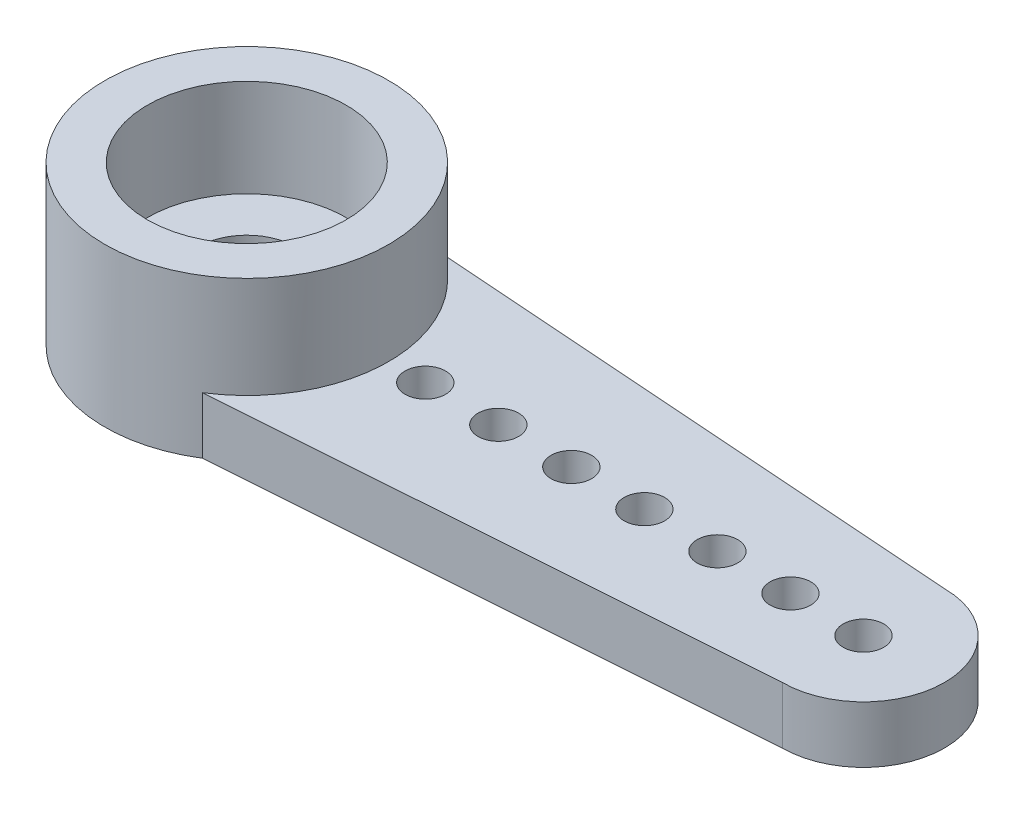
ISO-10303-21;
HEADER;
FILE_DESCRIPTION(('STEP AP214'),'2;1');
FILE_NAME('part.step','',(''),(''),'','','');
FILE_SCHEMA(('AUTOMOTIVE_DESIGN { 1 0 10303 214 1 1 1 1 }'));
ENDSEC;
DATA;
#1=APPLICATION_CONTEXT('core data for automotive mechanical design processes');
#2=APPLICATION_PROTOCOL_DEFINITION('international standard','automotive_design',2000,#1);
#3=PRODUCT_CONTEXT('',#1,'mechanical');
#4=PRODUCT('Part','Part','',(#3));
#5=PRODUCT_RELATED_PRODUCT_CATEGORY('part','',(#4));
#6=PRODUCT_DEFINITION_FORMATION('','',#4);
#7=PRODUCT_DEFINITION_CONTEXT('part definition',#1,'design');
#8=PRODUCT_DEFINITION('design','',#6,#7);
#9=PRODUCT_DEFINITION_SHAPE('','',#8);
#10=(LENGTH_UNIT() NAMED_UNIT(*) SI_UNIT(.MILLI.,.METRE.));
#11=(NAMED_UNIT(*) PLANE_ANGLE_UNIT() SI_UNIT($,.RADIAN.));
#12=(NAMED_UNIT(*) SI_UNIT($,.STERADIAN.) SOLID_ANGLE_UNIT());
#13=UNCERTAINTY_MEASURE_WITH_UNIT(LENGTH_MEASURE(1.E-05),#10,'distance_accuracy_value','');
#14=(GEOMETRIC_REPRESENTATION_CONTEXT(3) GLOBAL_UNCERTAINTY_ASSIGNED_CONTEXT((#13)) GLOBAL_UNIT_ASSIGNED_CONTEXT((#10,
#11,#12)) REPRESENTATION_CONTEXT('',''));
#15=CARTESIAN_POINT('',(0.,0.,0.));
#16=DIRECTION('',(0.,0.,1.));
#17=DIRECTION('',(1.,0.,0.));
#18=AXIS2_PLACEMENT_3D('',#15,#16,#17);
#19=CARTESIAN_POINT('',(-15.2,1.4,0.));
#20=DIRECTION('',(0.,1.,0.));
#21=DIRECTION('',(0.,0.,1.));
#22=AXIS2_PLACEMENT_3D('',#19,#20,#21);
#23=PLANE('',#22);
#24=CARTESIAN_POINT('',(6.2,1.4,0.));
#25=DIRECTION('',(0.,1.,0.));
#26=DIRECTION('',(0.,0.,1.));
#27=AXIS2_PLACEMENT_3D('',#24,#25,#26);
#28=CIRCLE('',#27,0.499999999999997);
#29=CARTESIAN_POINT('',(6.2,1.4,0.500000000000053));
#30=VERTEX_POINT('',#29);
#31=EDGE_CURVE('E127',#30,#30,#28,.T.);
#32=ORIENTED_EDGE('',*,*,#31,.F.);
#33=EDGE_LOOP('',(#32));
#34=FACE_BOUND('',#33,.T.);
#35=CARTESIAN_POINT('',(9.8,1.4,0.));
#36=DIRECTION('',(0.,1.,0.));
#37=DIRECTION('',(0.,0.,1.));
#38=AXIS2_PLACEMENT_3D('',#35,#36,#37);
#39=CIRCLE('',#38,0.499999999999997);
#40=CARTESIAN_POINT('',(9.8,1.4,0.500000000000028));
#41=VERTEX_POINT('',#40);
#42=EDGE_CURVE('E139',#41,#41,#39,.T.);
#43=ORIENTED_EDGE('',*,*,#42,.F.);
#44=EDGE_LOOP('',(#43));
#45=FACE_BOUND('',#44,.T.);
#46=CARTESIAN_POINT('',(13.4,1.4,0.));
#47=DIRECTION('',(0.,1.,0.));
#48=DIRECTION('',(0.,0.,1.));
#49=AXIS2_PLACEMENT_3D('',#46,#47,#48);
#50=CIRCLE('',#49,0.499999999999997);
#51=CARTESIAN_POINT('',(13.4,1.4,0.500000000000003));
#52=VERTEX_POINT('',#51);
#53=EDGE_CURVE('E151',#52,#52,#50,.T.);
#54=ORIENTED_EDGE('',*,*,#53,.F.);
#55=EDGE_LOOP('',(#54));
#56=FACE_BOUND('',#55,.T.);
#57=CARTESIAN_POINT('',(15.2,1.4,0.));
#58=DIRECTION('',(0.,1.,0.));
#59=DIRECTION('',(0.,0.,1.));
#60=AXIS2_PLACEMENT_3D('',#57,#58,#59);
#61=CIRCLE('',#60,0.499999999999997);
#62=CARTESIAN_POINT('',(15.2,1.4,0.49999999999999));
#63=VERTEX_POINT('',#62);
#64=EDGE_CURVE('E157',#63,#63,#61,.T.);
#65=ORIENTED_EDGE('',*,*,#64,.F.);
#66=EDGE_LOOP('',(#65));
#67=FACE_BOUND('',#66,.T.);
#68=CARTESIAN_POINT('',(11.6,1.4,0.));
#69=DIRECTION('',(0.,1.,0.));
#70=DIRECTION('',(0.,0.,1.));
#71=AXIS2_PLACEMENT_3D('',#68,#69,#70);
#72=CIRCLE('',#71,0.499999999999999);
#73=CARTESIAN_POINT('',(11.6,1.4,0.500000000000017));
#74=VERTEX_POINT('',#73);
#75=EDGE_CURVE('E145',#74,#74,#72,.T.);
#76=ORIENTED_EDGE('',*,*,#75,.F.);
#77=EDGE_LOOP('',(#76));
#78=FACE_BOUND('',#77,.T.);
#79=CARTESIAN_POINT('',(8.,1.4,0.));
#80=DIRECTION('',(0.,1.,0.));
#81=DIRECTION('',(0.,0.,1.));
#82=AXIS2_PLACEMENT_3D('',#79,#80,#81);
#83=CIRCLE('',#82,0.499999999999997);
#84=CARTESIAN_POINT('',(8.,1.4,0.500000000000041));
#85=VERTEX_POINT('',#84);
#86=EDGE_CURVE('E133',#85,#85,#83,.T.);
#87=ORIENTED_EDGE('',*,*,#86,.F.);
#88=EDGE_LOOP('',(#87));
#89=FACE_BOUND('',#88,.T.);
#90=CARTESIAN_POINT('',(4.4,1.4,0.));
#91=DIRECTION('',(0.,1.,0.));
#92=DIRECTION('',(0.,0.,1.));
#93=AXIS2_PLACEMENT_3D('',#90,#91,#92);
#94=CIRCLE('',#93,0.499999999999997);
#95=CARTESIAN_POINT('',(4.4,1.4,0.500000000000066));
#96=VERTEX_POINT('',#95);
#97=EDGE_CURVE('E121',#96,#96,#94,.T.);
#98=ORIENTED_EDGE('',*,*,#97,.F.);
#99=EDGE_LOOP('',(#98));
#100=FACE_BOUND('',#99,.T.);
#101=CARTESIAN_POINT('',(0.,1.4,0.));
#102=DIRECTION('',(0.,1.,0.));
#103=DIRECTION('',(0.,0.,1.));
#104=AXIS2_PLACEMENT_3D('',#101,#102,#103);
#105=CIRCLE('',#104,3.5);
#106=CARTESIAN_POINT('',(1.86858471289894,1.4,2.95945791838985));
#107=VERTEX_POINT('',#106);
#108=CARTESIAN_POINT('',(1.86858471289894,1.4,-2.95945791838985));
#109=VERTEX_POINT('',#108);
#110=EDGE_CURVE('E87',#107,#109,#105,.T.);
#111=ORIENTED_EDGE('',*,*,#110,.F.);
#112=DIRECTION('',(0.997420198870011,0.,-0.0717840294641297));
#113=VECTOR('',#112,1.);
#114=CARTESIAN_POINT('',(-14.9001527327747,1.4,4.16629887091939));
#115=LINE('',#114,#113);
#116=CARTESIAN_POINT('',(15.2,1.4,2.));
#117=VERTEX_POINT('',#116);
#118=EDGE_CURVE('E101',#107,#117,#115,.T.);
#119=ORIENTED_EDGE('',*,*,#118,.T.);
#120=CARTESIAN_POINT('',(15.2,1.4,0.));
#121=DIRECTION('',(0.,1.,0.));
#122=DIRECTION('',(0.,0.,-1.));
#123=AXIS2_PLACEMENT_3D('',#120,#121,#122);
#124=CIRCLE('',#123,2.);
#125=CARTESIAN_POINT('',(15.2,1.4,-2.));
#126=VERTEX_POINT('',#125);
#127=EDGE_CURVE('E163',#117,#126,#124,.T.);
#128=ORIENTED_EDGE('',*,*,#127,.T.);
#129=DIRECTION('',(-0.997420198870011,0.,-0.0717840294641295));
#130=VECTOR('',#129,1.);
#131=CARTESIAN_POINT('',(-14.9001527327747,1.4,-4.16629887091939));
#132=LINE('',#131,#130);
#133=EDGE_CURVE('E98',#126,#109,#132,.T.);
#134=ORIENTED_EDGE('',*,*,#133,.T.);
#135=EDGE_LOOP('',(#111,#119,#128,#134));
#136=FACE_BOUND('',#135,.T.);
#137=ADVANCED_FACE('F34',(#34,#45,#56,#67,#78,#89,#100,#136),#23,.T.);
#138=CARTESIAN_POINT('',(-15.2,0.,0.));
#139=DIRECTION('',(0.,1.,0.));
#140=DIRECTION('',(0.,0.,1.));
#141=AXIS2_PLACEMENT_3D('',#138,#139,#140);
#142=PLANE('',#141);
#143=CARTESIAN_POINT('',(0.,0.,0.));
#144=DIRECTION('',(0.,-1.,0.));
#145=DIRECTION('',(0.,0.,-1.));
#146=AXIS2_PLACEMENT_3D('',#143,#144,#145);
#147=CIRCLE('',#146,2.35);
#148=CARTESIAN_POINT('',(0.,0.,-2.35));
#149=VERTEX_POINT('',#148);
#150=EDGE_CURVE('E113',#149,#149,#147,.T.);
#151=ORIENTED_EDGE('',*,*,#150,.F.);
#152=EDGE_LOOP('',(#151));
#153=FACE_BOUND('',#152,.T.);
#154=CARTESIAN_POINT('',(15.2,0.,0.));
#155=DIRECTION('',(0.,1.,0.));
#156=DIRECTION('',(0.,0.,1.));
#157=AXIS2_PLACEMENT_3D('',#154,#155,#156);
#158=CIRCLE('',#157,0.499999999999997);
#159=CARTESIAN_POINT('',(15.2,0.,0.49999999999999));
#160=VERTEX_POINT('',#159);
#161=EDGE_CURVE('E154',#160,#160,#158,.T.);
#162=ORIENTED_EDGE('',*,*,#161,.T.);
#163=EDGE_LOOP('',(#162));
#164=FACE_BOUND('',#163,.T.);
#165=CARTESIAN_POINT('',(13.4,0.,0.));
#166=DIRECTION('',(0.,1.,0.));
#167=DIRECTION('',(0.,0.,1.));
#168=AXIS2_PLACEMENT_3D('',#165,#166,#167);
#169=CIRCLE('',#168,0.499999999999997);
#170=CARTESIAN_POINT('',(13.4,0.,0.500000000000003));
#171=VERTEX_POINT('',#170);
#172=EDGE_CURVE('E148',#171,#171,#169,.T.);
#173=ORIENTED_EDGE('',*,*,#172,.T.);
#174=EDGE_LOOP('',(#173));
#175=FACE_BOUND('',#174,.T.);
#176=CARTESIAN_POINT('',(11.6,0.,0.));
#177=DIRECTION('',(0.,1.,0.));
#178=DIRECTION('',(0.,0.,1.));
#179=AXIS2_PLACEMENT_3D('',#176,#177,#178);
#180=CIRCLE('',#179,0.499999999999999);
#181=CARTESIAN_POINT('',(11.6,0.,0.500000000000017));
#182=VERTEX_POINT('',#181);
#183=EDGE_CURVE('E142',#182,#182,#180,.T.);
#184=ORIENTED_EDGE('',*,*,#183,.T.);
#185=EDGE_LOOP('',(#184));
#186=FACE_BOUND('',#185,.T.);
#187=CARTESIAN_POINT('',(9.8,0.,0.));
#188=DIRECTION('',(0.,1.,0.));
#189=DIRECTION('',(0.,0.,1.));
#190=AXIS2_PLACEMENT_3D('',#187,#188,#189);
#191=CIRCLE('',#190,0.499999999999997);
#192=CARTESIAN_POINT('',(9.8,0.,0.500000000000028));
#193=VERTEX_POINT('',#192);
#194=EDGE_CURVE('E136',#193,#193,#191,.T.);
#195=ORIENTED_EDGE('',*,*,#194,.T.);
#196=EDGE_LOOP('',(#195));
#197=FACE_BOUND('',#196,.T.);
#198=CARTESIAN_POINT('',(8.,0.,0.));
#199=DIRECTION('',(0.,1.,0.));
#200=DIRECTION('',(0.,0.,1.));
#201=AXIS2_PLACEMENT_3D('',#198,#199,#200);
#202=CIRCLE('',#201,0.499999999999997);
#203=CARTESIAN_POINT('',(8.,0.,0.500000000000041));
#204=VERTEX_POINT('',#203);
#205=EDGE_CURVE('E130',#204,#204,#202,.T.);
#206=ORIENTED_EDGE('',*,*,#205,.T.);
#207=EDGE_LOOP('',(#206));
#208=FACE_BOUND('',#207,.T.);
#209=CARTESIAN_POINT('',(6.2,0.,0.));
#210=DIRECTION('',(0.,1.,0.));
#211=DIRECTION('',(0.,0.,1.));
#212=AXIS2_PLACEMENT_3D('',#209,#210,#211);
#213=CIRCLE('',#212,0.499999999999997);
#214=CARTESIAN_POINT('',(6.2,0.,0.500000000000053));
#215=VERTEX_POINT('',#214);
#216=EDGE_CURVE('E124',#215,#215,#213,.T.);
#217=ORIENTED_EDGE('',*,*,#216,.T.);
#218=EDGE_LOOP('',(#217));
#219=FACE_BOUND('',#218,.T.);
#220=CARTESIAN_POINT('',(4.4,0.,0.));
#221=DIRECTION('',(0.,1.,0.));
#222=DIRECTION('',(0.,0.,1.));
#223=AXIS2_PLACEMENT_3D('',#220,#221,#222);
#224=CIRCLE('',#223,0.499999999999997);
#225=CARTESIAN_POINT('',(4.4,0.,0.500000000000066));
#226=VERTEX_POINT('',#225);
#227=EDGE_CURVE('E118',#226,#226,#224,.T.);
#228=ORIENTED_EDGE('',*,*,#227,.T.);
#229=EDGE_LOOP('',(#228));
#230=FACE_BOUND('',#229,.T.);
#231=CARTESIAN_POINT('',(0.,0.,0.));
#232=DIRECTION('',(0.,-1.,0.));
#233=DIRECTION('',(0.,0.,-1.));
#234=AXIS2_PLACEMENT_3D('',#231,#232,#233);
#235=CIRCLE('',#234,3.5);
#236=CARTESIAN_POINT('',(1.86858471289894,0.,2.95945791838985));
#237=VERTEX_POINT('',#236);
#238=CARTESIAN_POINT('',(1.86858471289894,0.,-2.95945791838985));
#239=VERTEX_POINT('',#238);
#240=EDGE_CURVE('E72',#237,#239,#235,.T.);
#241=ORIENTED_EDGE('',*,*,#240,.T.);
#242=DIRECTION('',(0.997420198870011,0.,0.0717840294641295));
#243=VECTOR('',#242,1.);
#244=CARTESIAN_POINT('',(1.86858471289894,0.,-2.95945791838985));
#245=LINE('',#244,#243);
#246=CARTESIAN_POINT('',(15.2,0.,-2.));
#247=VERTEX_POINT('',#246);
#248=EDGE_CURVE('E77',#239,#247,#245,.T.);
#249=ORIENTED_EDGE('',*,*,#248,.T.);
#250=CARTESIAN_POINT('',(15.2,0.,0.));
#251=DIRECTION('',(0.,1.,0.));
#252=DIRECTION('',(0.,0.,-1.));
#253=AXIS2_PLACEMENT_3D('',#250,#251,#252);
#254=CIRCLE('',#253,2.);
#255=CARTESIAN_POINT('',(15.2,0.,1.99999999999999));
#256=VERTEX_POINT('',#255);
#257=EDGE_CURVE('E160',#256,#247,#254,.T.);
#258=ORIENTED_EDGE('',*,*,#257,.F.);
#259=DIRECTION('',(-0.997420198870011,0.,0.0717840294641296));
#260=VECTOR('',#259,1.);
#261=CARTESIAN_POINT('',(15.2,0.,2.));
#262=LINE('',#261,#260);
#263=EDGE_CURVE('E49',#256,#237,#262,.T.);
#264=ORIENTED_EDGE('',*,*,#263,.T.);
#265=EDGE_LOOP('',(#241,#249,#258,#264));
#266=FACE_BOUND('',#265,.T.);
#267=ADVANCED_FACE('F74',(#153,#164,#175,#186,#197,#208,#219,#230,#266),#142,.F.);
#268=CARTESIAN_POINT('',(15.2,1.4,0.));
#269=DIRECTION('',(0.,-1.,0.));
#270=DIRECTION('',(0.,0.,-1.));
#271=AXIS2_PLACEMENT_3D('',#268,#269,#270);
#272=CYLINDRICAL_SURFACE('',#271,2.);
#273=ORIENTED_EDGE('',*,*,#257,.T.);
#274=DIRECTION('',(0.,-1.,0.));
#275=VECTOR('',#274,1.);
#276=CARTESIAN_POINT('',(15.2,1.4,-2.00000000000001));
#277=LINE('',#276,#275);
#278=EDGE_CURVE('E94',#126,#247,#277,.T.);
#279=ORIENTED_EDGE('',*,*,#278,.F.);
#280=ORIENTED_EDGE('',*,*,#127,.F.);
#281=DIRECTION('',(0.,-1.,0.));
#282=VECTOR('',#281,1.);
#283=CARTESIAN_POINT('',(15.2,1.4,1.99999999999999));
#284=LINE('',#283,#282);
#285=EDGE_CURVE('E42',#117,#256,#284,.T.);
#286=ORIENTED_EDGE('',*,*,#285,.T.);
#287=EDGE_LOOP('',(#273,#279,#280,#286));
#288=FACE_BOUND('',#287,.T.);
#289=ADVANCED_FACE('F36',(#288),#272,.T.);
#290=CARTESIAN_POINT('',(15.2,1.4,0.));
#291=DIRECTION('',(0.,-1.,0.));
#292=DIRECTION('',(0.,0.,-1.));
#293=AXIS2_PLACEMENT_3D('',#290,#291,#292);
#294=CYLINDRICAL_SURFACE('',#293,0.499999999999997);
#295=ORIENTED_EDGE('',*,*,#64,.T.);
#296=EDGE_LOOP('',(#295));
#297=FACE_BOUND('',#296,.T.);
#298=ORIENTED_EDGE('',*,*,#161,.F.);
#299=EDGE_LOOP('',(#298));
#300=FACE_BOUND('',#299,.T.);
#301=ADVANCED_FACE('F222',(#297,#300),#294,.F.);
#302=CARTESIAN_POINT('',(13.4,1.4,0.));
#303=DIRECTION('',(0.,-1.,0.));
#304=DIRECTION('',(0.,0.,-1.));
#305=AXIS2_PLACEMENT_3D('',#302,#303,#304);
#306=CYLINDRICAL_SURFACE('',#305,0.499999999999997);
#307=ORIENTED_EDGE('',*,*,#53,.T.);
#308=EDGE_LOOP('',(#307));
#309=FACE_BOUND('',#308,.T.);
#310=ORIENTED_EDGE('',*,*,#172,.F.);
#311=EDGE_LOOP('',(#310));
#312=FACE_BOUND('',#311,.T.);
#313=ADVANCED_FACE('F225',(#309,#312),#306,.F.);
#314=CARTESIAN_POINT('',(11.6,1.4,0.));
#315=DIRECTION('',(0.,-1.,0.));
#316=DIRECTION('',(0.,0.,-1.));
#317=AXIS2_PLACEMENT_3D('',#314,#315,#316);
#318=CYLINDRICAL_SURFACE('',#317,0.499999999999999);
#319=ORIENTED_EDGE('',*,*,#75,.T.);
#320=EDGE_LOOP('',(#319));
#321=FACE_BOUND('',#320,.T.);
#322=ORIENTED_EDGE('',*,*,#183,.F.);
#323=EDGE_LOOP('',(#322));
#324=FACE_BOUND('',#323,.T.);
#325=ADVANCED_FACE('F229',(#321,#324),#318,.F.);
#326=CARTESIAN_POINT('',(9.8,1.4,0.));
#327=DIRECTION('',(0.,-1.,0.));
#328=DIRECTION('',(0.,0.,-1.));
#329=AXIS2_PLACEMENT_3D('',#326,#327,#328);
#330=CYLINDRICAL_SURFACE('',#329,0.499999999999997);
#331=ORIENTED_EDGE('',*,*,#42,.T.);
#332=EDGE_LOOP('',(#331));
#333=FACE_BOUND('',#332,.T.);
#334=ORIENTED_EDGE('',*,*,#194,.F.);
#335=EDGE_LOOP('',(#334));
#336=FACE_BOUND('',#335,.T.);
#337=ADVANCED_FACE('F233',(#333,#336),#330,.F.);
#338=CARTESIAN_POINT('',(8.,1.4,0.));
#339=DIRECTION('',(0.,-1.,0.));
#340=DIRECTION('',(0.,0.,-1.));
#341=AXIS2_PLACEMENT_3D('',#338,#339,#340);
#342=CYLINDRICAL_SURFACE('',#341,0.499999999999997);
#343=ORIENTED_EDGE('',*,*,#86,.T.);
#344=EDGE_LOOP('',(#343));
#345=FACE_BOUND('',#344,.T.);
#346=ORIENTED_EDGE('',*,*,#205,.F.);
#347=EDGE_LOOP('',(#346));
#348=FACE_BOUND('',#347,.T.);
#349=ADVANCED_FACE('F211',(#345,#348),#342,.F.);
#350=CARTESIAN_POINT('',(6.2,1.4,0.));
#351=DIRECTION('',(0.,-1.,0.));
#352=DIRECTION('',(0.,0.,-1.));
#353=AXIS2_PLACEMENT_3D('',#350,#351,#352);
#354=CYLINDRICAL_SURFACE('',#353,0.499999999999997);
#355=ORIENTED_EDGE('',*,*,#31,.T.);
#356=EDGE_LOOP('',(#355));
#357=FACE_BOUND('',#356,.T.);
#358=ORIENTED_EDGE('',*,*,#216,.F.);
#359=EDGE_LOOP('',(#358));
#360=FACE_BOUND('',#359,.T.);
#361=ADVANCED_FACE('F205',(#357,#360),#354,.F.);
#362=CARTESIAN_POINT('',(4.4,1.4,0.));
#363=DIRECTION('',(0.,-1.,0.));
#364=DIRECTION('',(0.,0.,-1.));
#365=AXIS2_PLACEMENT_3D('',#362,#363,#364);
#366=CYLINDRICAL_SURFACE('',#365,0.499999999999997);
#367=ORIENTED_EDGE('',*,*,#97,.T.);
#368=EDGE_LOOP('',(#367));
#369=FACE_BOUND('',#368,.T.);
#370=ORIENTED_EDGE('',*,*,#227,.F.);
#371=EDGE_LOOP('',(#370));
#372=FACE_BOUND('',#371,.T.);
#373=ADVANCED_FACE('F184',(#369,#372),#366,.F.);
#374=CARTESIAN_POINT('',(0.,1.,0.));
#375=DIRECTION('',(0.,-1.,0.));
#376=DIRECTION('',(0.,0.,-1.));
#377=AXIS2_PLACEMENT_3D('',#374,#375,#376);
#378=CYLINDRICAL_SURFACE('',#377,2.35);
#379=CARTESIAN_POINT('',(0.,1.,0.));
#380=DIRECTION('',(0.,-1.,0.));
#381=DIRECTION('',(0.,0.,-1.));
#382=AXIS2_PLACEMENT_3D('',#379,#380,#381);
#383=CIRCLE('',#382,2.35);
#384=CARTESIAN_POINT('',(0.,1.,-2.35));
#385=VERTEX_POINT('',#384);
#386=EDGE_CURVE('E115',#385,#385,#383,.T.);
#387=ORIENTED_EDGE('',*,*,#386,.F.);
#388=EDGE_LOOP('',(#387));
#389=FACE_BOUND('',#388,.T.);
#390=ORIENTED_EDGE('',*,*,#150,.T.);
#391=EDGE_LOOP('',(#390));
#392=FACE_BOUND('',#391,.T.);
#393=ADVANCED_FACE('F178',(#389,#392),#378,.F.);
#394=CARTESIAN_POINT('',(0.,1.,0.));
#395=DIRECTION('',(0.,-1.,0.));
#396=DIRECTION('',(0.,0.,-1.));
#397=AXIS2_PLACEMENT_3D('',#394,#395,#396);
#398=PLANE('',#397);
#399=CARTESIAN_POINT('',(0.,1.,0.));
#400=DIRECTION('',(0.,-1.,0.));
#401=DIRECTION('',(0.,0.,-1.));
#402=AXIS2_PLACEMENT_3D('',#399,#400,#401);
#403=CIRCLE('',#402,1.2);
#404=CARTESIAN_POINT('',(0.,1.,-1.2));
#405=VERTEX_POINT('',#404);
#406=EDGE_CURVE('E106',#405,#405,#403,.T.);
#407=ORIENTED_EDGE('',*,*,#406,.F.);
#408=EDGE_LOOP('',(#407));
#409=FACE_BOUND('',#408,.T.);
#410=ORIENTED_EDGE('',*,*,#386,.T.);
#411=EDGE_LOOP('',(#410));
#412=FACE_BOUND('',#411,.T.);
#413=ADVANCED_FACE('F174',(#409,#412),#398,.T.);
#414=CARTESIAN_POINT('',(0.,3.9,0.));
#415=DIRECTION('',(0.,1.,0.));
#416=DIRECTION('',(0.,0.,1.));
#417=AXIS2_PLACEMENT_3D('',#414,#415,#416);
#418=PLANE('',#417);
#419=CARTESIAN_POINT('',(0.,3.9,0.));
#420=DIRECTION('',(0.,1.,0.));
#421=DIRECTION('',(0.,0.,1.));
#422=AXIS2_PLACEMENT_3D('',#419,#420,#421);
#423=CIRCLE('',#422,3.5);
#424=CARTESIAN_POINT('',(0.,3.9,3.5));
#425=VERTEX_POINT('',#424);
#426=EDGE_CURVE('E110',#425,#425,#423,.T.);
#427=ORIENTED_EDGE('',*,*,#426,.T.);
#428=EDGE_LOOP('',(#427));
#429=FACE_BOUND('',#428,.T.);
#430=CARTESIAN_POINT('',(0.,3.9,0.));
#431=DIRECTION('',(0.,1.,0.));
#432=DIRECTION('',(0.,0.,1.));
#433=AXIS2_PLACEMENT_3D('',#430,#431,#432);
#434=CIRCLE('',#433,2.45);
#435=CARTESIAN_POINT('',(0.,3.9,2.45));
#436=VERTEX_POINT('',#435);
#437=EDGE_CURVE('E107',#436,#436,#434,.T.);
#438=ORIENTED_EDGE('',*,*,#437,.F.);
#439=EDGE_LOOP('',(#438));
#440=FACE_BOUND('',#439,.T.);
#441=ADVANCED_FACE('F177',(#429,#440),#418,.T.);
#442=CARTESIAN_POINT('',(0.,3.9,0.));
#443=DIRECTION('',(0.,-1.,0.));
#444=DIRECTION('',(0.,0.,-1.));
#445=AXIS2_PLACEMENT_3D('',#442,#443,#444);
#446=CYLINDRICAL_SURFACE('',#445,3.5);
#447=DIRECTION('',(0.,-1.,0.));
#448=VECTOR('',#447,1.);
#449=CARTESIAN_POINT('',(1.86858471289894,3.9,-2.95945791838985));
#450=LINE('',#449,#448);
#451=EDGE_CURVE('E81',#109,#239,#450,.T.);
#452=ORIENTED_EDGE('',*,*,#451,.T.);
#453=ORIENTED_EDGE('',*,*,#240,.F.);
#454=DIRECTION('',(0.,-1.,0.));
#455=VECTOR('',#454,1.);
#456=CARTESIAN_POINT('',(1.86858471289894,3.9,2.95945791838985));
#457=LINE('',#456,#455);
#458=EDGE_CURVE('E90',#107,#237,#457,.T.);
#459=ORIENTED_EDGE('',*,*,#458,.F.);
#460=ORIENTED_EDGE('',*,*,#110,.T.);
#461=EDGE_LOOP('',(#452,#453,#459,#460));
#462=FACE_BOUND('',#461,.T.);
#463=ORIENTED_EDGE('',*,*,#426,.F.);
#464=EDGE_LOOP('',(#463));
#465=FACE_BOUND('',#464,.T.);
#466=ADVANCED_FACE('F84',(#462,#465),#446,.T.);
#467=CARTESIAN_POINT('',(0.,3.9,0.));
#468=DIRECTION('',(0.,-1.,0.));
#469=DIRECTION('',(0.,0.,-1.));
#470=AXIS2_PLACEMENT_3D('',#467,#468,#469);
#471=CYLINDRICAL_SURFACE('',#470,2.45);
#472=CARTESIAN_POINT('',(0.,1.5,0.));
#473=DIRECTION('',(0.,1.,0.));
#474=DIRECTION('',(0.,0.,1.));
#475=AXIS2_PLACEMENT_3D('',#472,#473,#474);
#476=CIRCLE('',#475,2.45);
#477=CARTESIAN_POINT('',(0.,1.5,2.45));
#478=VERTEX_POINT('',#477);
#479=EDGE_CURVE('E11',#478,#478,#476,.T.);
#480=ORIENTED_EDGE('',*,*,#479,.F.);
#481=EDGE_LOOP('',(#480));
#482=FACE_BOUND('',#481,.T.);
#483=ORIENTED_EDGE('',*,*,#437,.T.);
#484=EDGE_LOOP('',(#483));
#485=FACE_BOUND('',#484,.T.);
#486=ADVANCED_FACE('F321',(#482,#485),#471,.F.);
#487=CARTESIAN_POINT('',(0.,0.,0.));
#488=DIRECTION('',(0.,1.,0.));
#489=DIRECTION('',(0.,0.,1.));
#490=AXIS2_PLACEMENT_3D('',#487,#488,#489);
#491=CYLINDRICAL_SURFACE('',#490,1.2);
#492=ORIENTED_EDGE('',*,*,#406,.T.);
#493=EDGE_LOOP('',(#492));
#494=FACE_BOUND('',#493,.T.);
#495=CARTESIAN_POINT('',(0.,1.5,0.));
#496=DIRECTION('',(0.,1.,0.));
#497=DIRECTION('',(0.,0.,1.));
#498=AXIS2_PLACEMENT_3D('',#495,#496,#497);
#499=CIRCLE('',#498,1.2);
#500=CARTESIAN_POINT('',(0.,1.5,1.2));
#501=VERTEX_POINT('',#500);
#502=EDGE_CURVE('E103',#501,#501,#499,.T.);
#503=ORIENTED_EDGE('',*,*,#502,.T.);
#504=EDGE_LOOP('',(#503));
#505=FACE_BOUND('',#504,.T.);
#506=ADVANCED_FACE('F171',(#494,#505),#491,.F.);
#507=CARTESIAN_POINT('',(0.,1.5,0.));
#508=DIRECTION('',(0.,1.,0.));
#509=DIRECTION('',(0.,0.,1.));
#510=AXIS2_PLACEMENT_3D('',#507,#508,#509);
#511=PLANE('',#510);
#512=ORIENTED_EDGE('',*,*,#479,.T.);
#513=EDGE_LOOP('',(#512));
#514=FACE_BOUND('',#513,.T.);
#515=ORIENTED_EDGE('',*,*,#502,.F.);
#516=EDGE_LOOP('',(#515));
#517=FACE_BOUND('',#516,.T.);
#518=ADVANCED_FACE('F307',(#514,#517),#511,.T.);
#519=CARTESIAN_POINT('',(1.86858471289894,3.9,-2.95945791838985));
#520=DIRECTION('',(0.0717840294641295,0.,-0.997420198870011));
#521=DIRECTION('',(-0.997420198870011,0.,-0.0717840294641295));
#522=AXIS2_PLACEMENT_3D('',#519,#520,#521);
#523=PLANE('',#522);
#524=ORIENTED_EDGE('',*,*,#278,.T.);
#525=ORIENTED_EDGE('',*,*,#248,.F.);
#526=ORIENTED_EDGE('',*,*,#451,.F.);
#527=ORIENTED_EDGE('',*,*,#133,.F.);
#528=EDGE_LOOP('',(#524,#525,#526,#527));
#529=FACE_BOUND('',#528,.T.);
#530=ADVANCED_FACE('F92',(#529),#523,.T.);
#531=CARTESIAN_POINT('',(15.2,3.9,2.));
#532=DIRECTION('',(0.0717840294641297,0.,0.997420198870011));
#533=DIRECTION('',(0.997420198870011,0.,-0.0717840294641297));
#534=AXIS2_PLACEMENT_3D('',#531,#532,#533);
#535=PLANE('',#534);
#536=ORIENTED_EDGE('',*,*,#458,.T.);
#537=ORIENTED_EDGE('',*,*,#263,.F.);
#538=ORIENTED_EDGE('',*,*,#285,.F.);
#539=ORIENTED_EDGE('',*,*,#118,.F.);
#540=EDGE_LOOP('',(#536,#537,#538,#539));
#541=FACE_BOUND('',#540,.T.);
#542=ADVANCED_FACE('F346',(#541),#535,.T.);
#543=CLOSED_SHELL('',(#137,#267,#289,#301,#313,#325,#337,#349,#361,#373,#393,#413,#441,#466,
#486,#506,#518,#530,#542));
#544=MANIFOLD_SOLID_BREP('B2',#543);
#545=ADVANCED_BREP_SHAPE_REPRESENTATION('',(#18,#544),#14);
#546=SHAPE_DEFINITION_REPRESENTATION(#9,#545);
ENDSEC;
END-ISO-10303-21;
